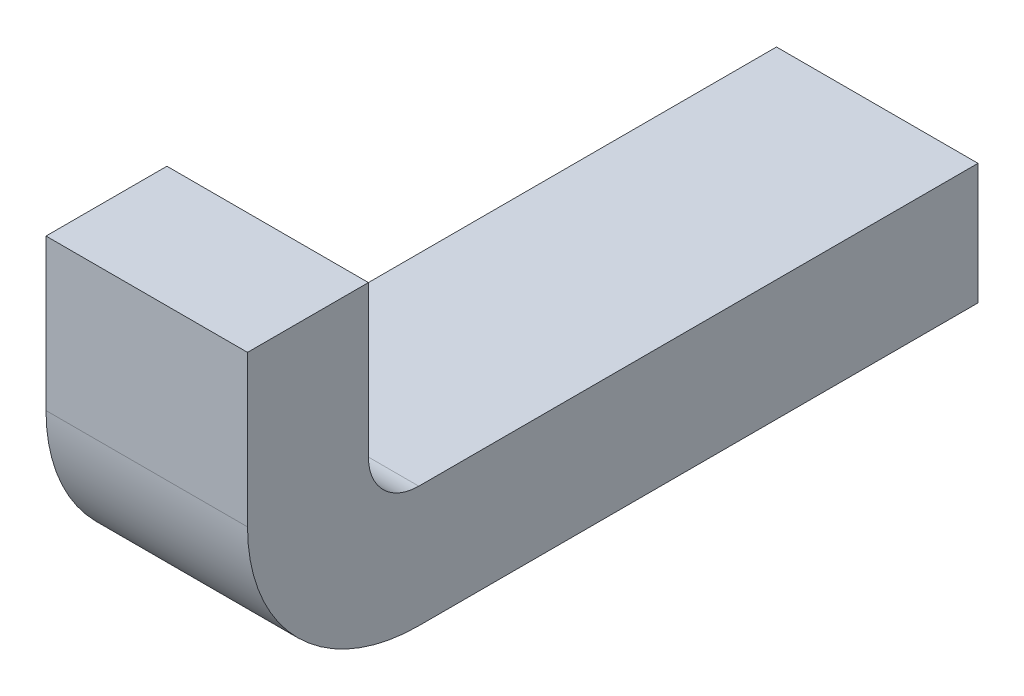
ISO-10303-21;
HEADER;
FILE_DESCRIPTION(('STEP AP214'),'2;1');
FILE_NAME('part.step','',(''),(''),'','','');
FILE_SCHEMA(('AUTOMOTIVE_DESIGN { 1 0 10303 214 1 1 1 1 }'));
ENDSEC;
DATA;
#1=APPLICATION_CONTEXT('core data for automotive mechanical design processes');
#2=APPLICATION_PROTOCOL_DEFINITION('international standard','automotive_design',2000,#1);
#3=PRODUCT_CONTEXT('',#1,'mechanical');
#4=PRODUCT('Part','Part','',(#3));
#5=PRODUCT_RELATED_PRODUCT_CATEGORY('part','',(#4));
#6=PRODUCT_DEFINITION_FORMATION('','',#4);
#7=PRODUCT_DEFINITION_CONTEXT('part definition',#1,'design');
#8=PRODUCT_DEFINITION('design','',#6,#7);
#9=PRODUCT_DEFINITION_SHAPE('','',#8);
#10=(LENGTH_UNIT() NAMED_UNIT(*) SI_UNIT(.MILLI.,.METRE.));
#11=(NAMED_UNIT(*) PLANE_ANGLE_UNIT() SI_UNIT($,.RADIAN.));
#12=(NAMED_UNIT(*) SI_UNIT($,.STERADIAN.) SOLID_ANGLE_UNIT());
#13=UNCERTAINTY_MEASURE_WITH_UNIT(LENGTH_MEASURE(1.E-05),#10,'distance_accuracy_value','');
#14=(GEOMETRIC_REPRESENTATION_CONTEXT(3) GLOBAL_UNCERTAINTY_ASSIGNED_CONTEXT((#13)) GLOBAL_UNIT_ASSIGNED_CONTEXT((#10,
#11,#12)) REPRESENTATION_CONTEXT('',''));
#15=CARTESIAN_POINT('',(0.,0.,0.));
#16=DIRECTION('',(0.,0.,1.));
#17=DIRECTION('',(1.,0.,0.));
#18=AXIS2_PLACEMENT_3D('',#15,#16,#17);
#19=CARTESIAN_POINT('',(0.65,0.,-3.300000000002));
#20=DIRECTION('',(0.,-1.,0.));
#21=DIRECTION('',(1.,0.,0.));
#22=AXIS2_PLACEMENT_3D('',#19,#20,#21);
#23=PLANE('',#22);
#24=DIRECTION('',(0.,0.,1.));
#25=VECTOR('',#24,1.);
#26=CARTESIAN_POINT('',(0.65,0.,-3.300000000002));
#27=LINE('',#26,#25);
#28=CARTESIAN_POINT('',(0.65,0.,-3.300000000002));
#29=VERTEX_POINT('',#28);
#30=CARTESIAN_POINT('',(0.65,0.,-3.854999999999));
#31=VERTEX_POINT('',#30);
#32=EDGE_CURVE('E121',#29,#31,#27,.F.);
#33=ORIENTED_EDGE('',*,*,#32,.T.);
#34=DIRECTION('',(-1.,0.,0.));
#35=VECTOR('',#34,1.);
#36=CARTESIAN_POINT('',(0.65,0.,-3.854999999999));
#37=LINE('',#36,#35);
#38=CARTESIAN_POINT('',(0.85,0.,-3.854999999999));
#39=VERTEX_POINT('',#38);
#40=EDGE_CURVE('E124',#39,#31,#37,.T.);
#41=ORIENTED_EDGE('',*,*,#40,.F.);
#42=DIRECTION('',(0.,0.,1.));
#43=VECTOR('',#42,1.);
#44=CARTESIAN_POINT('',(0.85,0.,-3.300000000002));
#45=LINE('',#44,#43);
#46=CARTESIAN_POINT('',(0.85,0.,-3.300000000002));
#47=VERTEX_POINT('',#46);
#48=EDGE_CURVE('E154',#47,#39,#45,.F.);
#49=ORIENTED_EDGE('',*,*,#48,.F.);
#50=DIRECTION('',(1.,0.,0.));
#51=VECTOR('',#50,1.);
#52=CARTESIAN_POINT('',(0.65,0.,-3.300000000002));
#53=LINE('',#52,#51);
#54=EDGE_CURVE('E63',#29,#47,#53,.T.);
#55=ORIENTED_EDGE('',*,*,#54,.F.);
#56=EDGE_LOOP('',(#33,#41,#49,#55));
#57=FACE_BOUND('',#56,.T.);
#58=ADVANCED_FACE('F16',(#57),#23,.T.);
#59=CARTESIAN_POINT('',(0.65,0.32,-3.250000000002));
#60=DIRECTION('',(0.,1.,1.246832498358E-13));
#61=DIRECTION('',(0.,-1.246832498358E-13,1.));
#62=AXIS2_PLACEMENT_3D('',#59,#60,#61);
#63=PLANE('',#62);
#64=DIRECTION('',(0.,0.,1.));
#65=VECTOR('',#64,1.);
#66=CARTESIAN_POINT('',(0.65,0.32,-3.300000000002));
#67=LINE('',#66,#65);
#68=CARTESIAN_POINT('',(0.65,0.32,-3.250000000002));
#69=VERTEX_POINT('',#68);
#70=CARTESIAN_POINT('',(0.65,0.32,-3.130000000002));
#71=VERTEX_POINT('',#70);
#72=EDGE_CURVE('E100',#69,#71,#67,.T.);
#73=ORIENTED_EDGE('',*,*,#72,.T.);
#74=DIRECTION('',(1.,0.,0.));
#75=VECTOR('',#74,1.);
#76=CARTESIAN_POINT('',(0.65,0.32,-3.130000000002));
#77=LINE('',#76,#75);
#78=CARTESIAN_POINT('',(0.85,0.32,-3.130000000002));
#79=VERTEX_POINT('',#78);
#80=EDGE_CURVE('E162',#79,#71,#77,.F.);
#81=ORIENTED_EDGE('',*,*,#80,.F.);
#82=DIRECTION('',(0.,0.,1.));
#83=VECTOR('',#82,1.);
#84=CARTESIAN_POINT('',(0.85,0.32,-3.300000000002));
#85=LINE('',#84,#83);
#86=CARTESIAN_POINT('',(0.85,0.32,-3.250000000002));
#87=VERTEX_POINT('',#86);
#88=EDGE_CURVE('E150',#87,#79,#85,.T.);
#89=ORIENTED_EDGE('',*,*,#88,.F.);
#90=DIRECTION('',(-1.,0.,0.));
#91=VECTOR('',#90,1.);
#92=CARTESIAN_POINT('',(0.65,0.32,-3.250000000002));
#93=LINE('',#92,#91);
#94=EDGE_CURVE('E72',#69,#87,#93,.F.);
#95=ORIENTED_EDGE('',*,*,#94,.F.);
#96=EDGE_LOOP('',(#73,#81,#89,#95));
#97=FACE_BOUND('',#96,.T.);
#98=ADVANCED_FACE('F182',(#97),#63,.T.);
#99=CARTESIAN_POINT('',(0.65,0.32,-3.130000000002));
#100=DIRECTION('',(0.,0.,1.));
#101=DIRECTION('',(1.,0.,0.));
#102=AXIS2_PLACEMENT_3D('',#99,#100,#101);
#103=PLANE('',#102);
#104=DIRECTION('',(0.,1.,0.));
#105=VECTOR('',#104,1.);
#106=CARTESIAN_POINT('',(0.65,0.17,-3.130000000002));
#107=LINE('',#106,#105);
#108=CARTESIAN_POINT('',(0.65,0.17,-3.130000000002));
#109=VERTEX_POINT('',#108);
#110=EDGE_CURVE('E110',#71,#109,#107,.F.);
#111=ORIENTED_EDGE('',*,*,#110,.T.);
#112=DIRECTION('',(1.,0.,0.));
#113=VECTOR('',#112,1.);
#114=CARTESIAN_POINT('',(0.65,0.17,-3.130000000002));
#115=LINE('',#114,#113);
#116=CARTESIAN_POINT('',(0.85,0.17,-3.130000000002));
#117=VERTEX_POINT('',#116);
#118=EDGE_CURVE('E57',#117,#109,#115,.F.);
#119=ORIENTED_EDGE('',*,*,#118,.F.);
#120=DIRECTION('',(0.,1.,0.));
#121=VECTOR('',#120,1.);
#122=CARTESIAN_POINT('',(0.85,0.17,-3.130000000002));
#123=LINE('',#122,#121);
#124=EDGE_CURVE('E141',#79,#117,#123,.F.);
#125=ORIENTED_EDGE('',*,*,#124,.F.);
#126=ORIENTED_EDGE('',*,*,#80,.T.);
#127=EDGE_LOOP('',(#111,#119,#125,#126));
#128=FACE_BOUND('',#127,.T.);
#129=ADVANCED_FACE('F183',(#128),#103,.T.);
#130=CARTESIAN_POINT('',(0.65,0.17,-3.300000000002));
#131=DIRECTION('',(1.,0.,0.));
#132=DIRECTION('',(0.,1.,0.));
#133=AXIS2_PLACEMENT_3D('',#130,#131,#132);
#134=CYLINDRICAL_SURFACE('',#133,0.17);
#135=CARTESIAN_POINT('',(0.65,0.17,-3.300000000002));
#136=DIRECTION('',(1.,0.,0.));
#137=DIRECTION('',(0.,1.,0.));
#138=AXIS2_PLACEMENT_3D('',#135,#136,#137);
#139=CIRCLE('',#138,0.17);
#140=EDGE_CURVE('E96',#109,#29,#139,.T.);
#141=ORIENTED_EDGE('',*,*,#140,.T.);
#142=ORIENTED_EDGE('',*,*,#54,.T.);
#143=CARTESIAN_POINT('',(0.85,0.17,-3.300000000002));
#144=DIRECTION('',(1.,0.,0.));
#145=DIRECTION('',(0.,1.,0.));
#146=AXIS2_PLACEMENT_3D('',#143,#144,#145);
#147=CIRCLE('',#146,0.17);
#148=EDGE_CURVE('E19',#117,#47,#147,.T.);
#149=ORIENTED_EDGE('',*,*,#148,.F.);
#150=ORIENTED_EDGE('',*,*,#118,.T.);
#151=EDGE_LOOP('',(#141,#142,#149,#150));
#152=FACE_BOUND('',#151,.T.);
#153=ADVANCED_FACE('F185',(#152),#134,.T.);
#154=CARTESIAN_POINT('',(0.65,0.17,-3.250000000002));
#155=DIRECTION('',(0.,0.,-1.));
#156=DIRECTION('',(-1.,0.,0.));
#157=AXIS2_PLACEMENT_3D('',#154,#155,#156);
#158=PLANE('',#157);
#159=DIRECTION('',(0.,1.,0.));
#160=VECTOR('',#159,1.);
#161=CARTESIAN_POINT('',(0.65,0.17,-3.250000000002));
#162=LINE('',#161,#160);
#163=CARTESIAN_POINT('',(0.65,0.17,-3.250000000002));
#164=VERTEX_POINT('',#163);
#165=EDGE_CURVE('E92',#164,#69,#162,.T.);
#166=ORIENTED_EDGE('',*,*,#165,.T.);
#167=ORIENTED_EDGE('',*,*,#94,.T.);
#168=DIRECTION('',(0.,1.,0.));
#169=VECTOR('',#168,1.);
#170=CARTESIAN_POINT('',(0.85,0.17,-3.250000000002));
#171=LINE('',#170,#169);
#172=CARTESIAN_POINT('',(0.85,0.17,-3.250000000002));
#173=VERTEX_POINT('',#172);
#174=EDGE_CURVE('E87',#173,#87,#171,.T.);
#175=ORIENTED_EDGE('',*,*,#174,.F.);
#176=DIRECTION('',(1.,0.,0.));
#177=VECTOR('',#176,1.);
#178=CARTESIAN_POINT('',(0.65,0.17,-3.250000000002));
#179=LINE('',#178,#177);
#180=EDGE_CURVE('E90',#173,#164,#179,.F.);
#181=ORIENTED_EDGE('',*,*,#180,.T.);
#182=EDGE_LOOP('',(#166,#167,#175,#181));
#183=FACE_BOUND('',#182,.T.);
#184=ADVANCED_FACE('F91',(#183),#158,.T.);
#185=CARTESIAN_POINT('',(0.85,0.17,-3.300000000002));
#186=DIRECTION('',(1.,0.,0.));
#187=DIRECTION('',(0.,1.,0.));
#188=AXIS2_PLACEMENT_3D('',#185,#186,#187);
#189=PLANE('',#188);
#190=ORIENTED_EDGE('',*,*,#88,.T.);
#191=ORIENTED_EDGE('',*,*,#124,.T.);
#192=ORIENTED_EDGE('',*,*,#148,.T.);
#193=ORIENTED_EDGE('',*,*,#48,.T.);
#194=DIRECTION('',(0.,1.,0.));
#195=VECTOR('',#194,1.);
#196=CARTESIAN_POINT('',(0.85,0.,-3.854999999999));
#197=LINE('',#196,#195);
#198=CARTESIAN_POINT('',(0.85,0.12,-3.854999999999));
#199=VERTEX_POINT('',#198);
#200=EDGE_CURVE('E138',#199,#39,#197,.F.);
#201=ORIENTED_EDGE('',*,*,#200,.F.);
#202=DIRECTION('',(0.,0.,1.));
#203=VECTOR('',#202,1.);
#204=CARTESIAN_POINT('',(0.85,0.12,-3.854999999999));
#205=LINE('',#204,#203);
#206=CARTESIAN_POINT('',(0.85,0.119999999999999,-3.300000000002));
#207=VERTEX_POINT('',#206);
#208=EDGE_CURVE('E107',#207,#199,#205,.F.);
#209=ORIENTED_EDGE('',*,*,#208,.F.);
#210=CARTESIAN_POINT('',(0.85,0.17,-3.300000000002));
#211=DIRECTION('',(1.,0.,0.));
#212=DIRECTION('',(0.,1.,0.));
#213=AXIS2_PLACEMENT_3D('',#210,#211,#212);
#214=CIRCLE('',#213,0.05);
#215=EDGE_CURVE('E105',#207,#173,#214,.F.);
#216=ORIENTED_EDGE('',*,*,#215,.T.);
#217=ORIENTED_EDGE('',*,*,#174,.T.);
#218=EDGE_LOOP('',(#190,#191,#192,#193,#201,#209,#216,#217));
#219=FACE_BOUND('',#218,.T.);
#220=ADVANCED_FACE('F179',(#219),#189,.T.);
#221=CARTESIAN_POINT('',(0.65,0.,-3.854999999999));
#222=DIRECTION('',(0.,0.,-1.));
#223=DIRECTION('',(-1.,0.,0.));
#224=AXIS2_PLACEMENT_3D('',#221,#222,#223);
#225=PLANE('',#224);
#226=DIRECTION('',(0.,1.,0.));
#227=VECTOR('',#226,1.);
#228=CARTESIAN_POINT('',(0.65,0.17,-3.854999999999));
#229=LINE('',#228,#227);
#230=CARTESIAN_POINT('',(0.65,0.12,-3.854999999999));
#231=VERTEX_POINT('',#230);
#232=EDGE_CURVE('E101',#31,#231,#229,.T.);
#233=ORIENTED_EDGE('',*,*,#232,.T.);
#234=DIRECTION('',(-1.,0.,0.));
#235=VECTOR('',#234,1.);
#236=CARTESIAN_POINT('',(0.65,0.12,-3.854999999999));
#237=LINE('',#236,#235);
#238=EDGE_CURVE('E128',#199,#231,#237,.T.);
#239=ORIENTED_EDGE('',*,*,#238,.F.);
#240=ORIENTED_EDGE('',*,*,#200,.T.);
#241=ORIENTED_EDGE('',*,*,#40,.T.);
#242=EDGE_LOOP('',(#233,#239,#240,#241));
#243=FACE_BOUND('',#242,.T.);
#244=ADVANCED_FACE('F204',(#243),#225,.T.);
#245=CARTESIAN_POINT('',(0.65,0.17,-3.300000000002));
#246=DIRECTION('',(1.,0.,0.));
#247=DIRECTION('',(0.,1.,0.));
#248=AXIS2_PLACEMENT_3D('',#245,#246,#247);
#249=PLANE('',#248);
#250=ORIENTED_EDGE('',*,*,#110,.F.);
#251=ORIENTED_EDGE('',*,*,#72,.F.);
#252=ORIENTED_EDGE('',*,*,#165,.F.);
#253=CARTESIAN_POINT('',(0.65,0.17,-3.300000000002));
#254=DIRECTION('',(1.,0.,0.));
#255=DIRECTION('',(0.,1.,0.));
#256=AXIS2_PLACEMENT_3D('',#253,#254,#255);
#257=CIRCLE('',#256,0.05);
#258=CARTESIAN_POINT('',(0.65,0.12,-3.300000000002));
#259=VERTEX_POINT('',#258);
#260=EDGE_CURVE('E34',#164,#259,#257,.T.);
#261=ORIENTED_EDGE('',*,*,#260,.T.);
#262=DIRECTION('',(0.,0.,1.));
#263=VECTOR('',#262,1.);
#264=CARTESIAN_POINT('',(0.65,0.12,-3.854999999999));
#265=LINE('',#264,#263);
#266=EDGE_CURVE('E25',#231,#259,#265,.T.);
#267=ORIENTED_EDGE('',*,*,#266,.F.);
#268=ORIENTED_EDGE('',*,*,#232,.F.);
#269=ORIENTED_EDGE('',*,*,#32,.F.);
#270=ORIENTED_EDGE('',*,*,#140,.F.);
#271=EDGE_LOOP('',(#250,#251,#252,#261,#267,#268,#269,#270));
#272=FACE_BOUND('',#271,.T.);
#273=ADVANCED_FACE('F99',(#272),#249,.F.);
#274=CARTESIAN_POINT('',(0.65,0.17,-3.300000000002));
#275=DIRECTION('',(1.,0.,0.));
#276=DIRECTION('',(0.,1.,0.));
#277=AXIS2_PLACEMENT_3D('',#274,#275,#276);
#278=CYLINDRICAL_SURFACE('',#277,0.05);
#279=DIRECTION('',(-1.,0.,0.));
#280=VECTOR('',#279,1.);
#281=CARTESIAN_POINT('',(0.65,0.12,-3.300000000002));
#282=LINE('',#281,#280);
#283=EDGE_CURVE('E11',#259,#207,#282,.F.);
#284=ORIENTED_EDGE('',*,*,#283,.F.);
#285=ORIENTED_EDGE('',*,*,#260,.F.);
#286=ORIENTED_EDGE('',*,*,#180,.F.);
#287=ORIENTED_EDGE('',*,*,#215,.F.);
#288=EDGE_LOOP('',(#284,#285,#286,#287));
#289=FACE_BOUND('',#288,.T.);
#290=ADVANCED_FACE('F103',(#289),#278,.F.);
#291=CARTESIAN_POINT('',(0.65,0.12,-3.854999999999));
#292=DIRECTION('',(0.,1.,0.));
#293=DIRECTION('',(-1.,0.,0.));
#294=AXIS2_PLACEMENT_3D('',#291,#292,#293);
#295=PLANE('',#294);
#296=ORIENTED_EDGE('',*,*,#266,.T.);
#297=ORIENTED_EDGE('',*,*,#283,.T.);
#298=ORIENTED_EDGE('',*,*,#208,.T.);
#299=ORIENTED_EDGE('',*,*,#238,.T.);
#300=EDGE_LOOP('',(#296,#297,#298,#299));
#301=FACE_BOUND('',#300,.T.);
#302=ADVANCED_FACE('F193',(#301),#295,.T.);
#303=CLOSED_SHELL('',(#58,#98,#129,#153,#184,#220,#244,#273,#290,#302));
#304=MANIFOLD_SOLID_BREP('B1',#303);
#305=ADVANCED_BREP_SHAPE_REPRESENTATION('',(#18,#304),#14);
#306=SHAPE_DEFINITION_REPRESENTATION(#9,#305);
ENDSEC;
END-ISO-10303-21;
